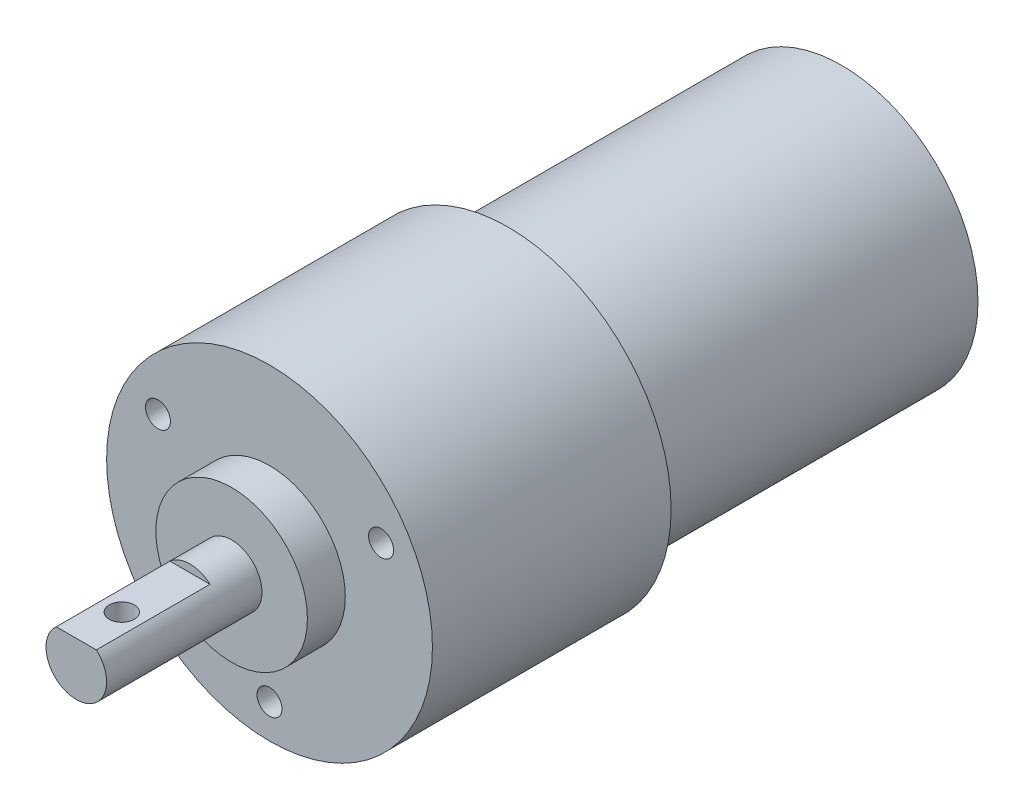
ISO-10303-21;
HEADER;
FILE_DESCRIPTION(('STEP AP214'),'2;1');
FILE_NAME('part.step','',(''),(''),'','','');
FILE_SCHEMA(('AUTOMOTIVE_DESIGN { 1 0 10303 214 1 1 1 1 }'));
ENDSEC;
DATA;
#1=APPLICATION_CONTEXT('core data for automotive mechanical design processes');
#2=APPLICATION_PROTOCOL_DEFINITION('international standard','automotive_design',2000,#1);
#3=PRODUCT_CONTEXT('',#1,'mechanical');
#4=PRODUCT('Part','Part','',(#3));
#5=PRODUCT_RELATED_PRODUCT_CATEGORY('part','',(#4));
#6=PRODUCT_DEFINITION_FORMATION('','',#4);
#7=PRODUCT_DEFINITION_CONTEXT('part definition',#1,'design');
#8=PRODUCT_DEFINITION('design','',#6,#7);
#9=PRODUCT_DEFINITION_SHAPE('','',#8);
#10=(LENGTH_UNIT() NAMED_UNIT(*) SI_UNIT(.MILLI.,.METRE.));
#11=(NAMED_UNIT(*) PLANE_ANGLE_UNIT() SI_UNIT($,.RADIAN.));
#12=(NAMED_UNIT(*) SI_UNIT($,.STERADIAN.) SOLID_ANGLE_UNIT());
#13=UNCERTAINTY_MEASURE_WITH_UNIT(LENGTH_MEASURE(1.E-05),#10,'distance_accuracy_value','');
#14=(GEOMETRIC_REPRESENTATION_CONTEXT(3) GLOBAL_UNCERTAINTY_ASSIGNED_CONTEXT((#13)) GLOBAL_UNIT_ASSIGNED_CONTEXT((#10,
#11,#12)) REPRESENTATION_CONTEXT('',''));
#15=CARTESIAN_POINT('',(0.,0.,0.));
#16=DIRECTION('',(0.,0.,1.));
#17=DIRECTION('',(1.,0.,0.));
#18=AXIS2_PLACEMENT_3D('',#15,#16,#17);
#19=CARTESIAN_POINT('',(0.,0.,57.));
#20=DIRECTION('',(0.,0.,-1.));
#21=DIRECTION('',(-1.,0.,0.));
#22=AXIS2_PLACEMENT_3D('',#19,#20,#21);
#23=CYLINDRICAL_SURFACE('',#22,4.);
#24=CARTESIAN_POINT('',(0.,-4.,52.65));
#25=CARTESIAN_POINT('',(0.0884596783632788,-3.99999309817074,52.6499907827934));
#26=CARTESIAN_POINT('',(0.177062252057582,-3.99703145792172,52.6428439856567));
#27=CARTESIAN_POINT('',(0.351759669836408,-3.9854711320255,52.6145088580631));
#28=CARTESIAN_POINT('',(0.437847271996959,-3.97685757767606,52.5932834889757));
#29=CARTESIAN_POINT('',(0.604702496902739,-3.95491965529936,52.5377051877981));
#30=CARTESIAN_POINT('',(0.685486934491194,-3.94161112398211,52.5033963566465));
#31=CARTESIAN_POINT('',(0.840076633223485,-3.91158286286531,52.4228052421506));
#32=CARTESIAN_POINT('',(0.913884076117563,-3.89486420463244,52.3765267188298));
#33=CARTESIAN_POINT('',(1.05618769598525,-3.85876900012149,52.2708932453559));
#34=CARTESIAN_POINT('',(1.12429373957476,-3.83930654387258,52.211042329751));
#35=CARTESIAN_POINT('',(1.24983574384757,-3.80029483347099,52.081011160341));
#36=CARTESIAN_POINT('',(1.30726618926956,-3.78074553976622,52.0108256007882));
#37=CARTESIAN_POINT('',(1.41254826809049,-3.74272551686067,51.8580317511283));
#38=CARTESIAN_POINT('',(1.45980781790561,-3.72435159658093,51.7749888846935));
#39=CARTESIAN_POINT('',(1.53951358199406,-3.69212136090386,51.6012636907098));
#40=CARTESIAN_POINT('',(1.5719672771279,-3.67826276509115,51.510585248637));
#41=CARTESIAN_POINT('',(1.61953738222491,-3.65756021871623,51.3286520029982));
#42=CARTESIAN_POINT('',(1.63540371417153,-3.65041449103237,51.2376289278569));
#43=CARTESIAN_POINT('',(1.65168918120802,-3.64307714795703,51.0539534926347));
#44=CARTESIAN_POINT('',(1.65211659474,-3.64288180572738,50.9613020323707));
#45=CARTESIAN_POINT('',(1.63807780779829,-3.64921138579605,50.7844011133813));
#46=CARTESIAN_POINT('',(1.62472398487458,-3.6552343974104,50.7000418412508));
#47=CARTESIAN_POINT('',(1.58536484231197,-3.67247532251837,50.5348897156188));
#48=CARTESIAN_POINT('',(1.55935715587184,-3.68369420783859,50.4540975323967));
#49=CARTESIAN_POINT('',(1.49492412942488,-3.71031458481431,50.2963548912414));
#50=CARTESIAN_POINT('',(1.45624866973016,-3.72579923184191,50.2195212621917));
#51=CARTESIAN_POINT('',(1.36775445443624,-3.75918616236907,50.07313976754));
#52=CARTESIAN_POINT('',(1.31793135478158,-3.77708938726885,50.0035947577509));
#53=CARTESIAN_POINT('',(1.20371911924868,-3.81509742396095,49.8677135922122));
#54=CARTESIAN_POINT('',(1.13846630094388,-3.8352618825369,49.8021180422967));
#55=CARTESIAN_POINT('',(0.99768255486621,-3.87426910607353,49.6825553255586));
#56=CARTESIAN_POINT('',(0.922149319847429,-3.8931115728953,49.6285907761392));
#57=CARTESIAN_POINT('',(0.76073636973732,-3.92787932271737,49.532765226415));
#58=CARTESIAN_POINT('',(0.674664094072232,-3.94373050716791,49.4911997168058));
#59=CARTESIAN_POINT('',(0.495928253552973,-3.97016319816605,49.4233969758911));
#60=CARTESIAN_POINT('',(0.403268287372381,-3.98074755693754,49.3971514467888));
#61=CARTESIAN_POINT('',(0.22018130431767,-3.99492450637935,49.3622704963218));
#62=CARTESIAN_POINT('',(0.129974172308219,-3.99891121146315,49.3526408220641));
#63=CARTESIAN_POINT('',(-0.0508474401522242,-4.00069746426785,49.3483079562367));
#64=CARTESIAN_POINT('',(-0.141461799500568,-3.99849874371343,49.3536005868918));
#65=CARTESIAN_POINT('',(-0.31590775548755,-3.98841747083847,49.378245268243));
#66=CARTESIAN_POINT('',(-0.399855317526687,-3.9808153168881,49.3969040733401));
#67=CARTESIAN_POINT('',(-0.563340473329576,-3.96098887803091,49.4467920963371));
#68=CARTESIAN_POINT('',(-0.642877505872146,-3.94876400644332,49.4780229098148));
#69=CARTESIAN_POINT('',(-0.798061975964474,-3.92039728883464,49.5531893799809));
#70=CARTESIAN_POINT('',(-0.873512656660505,-3.90414585630856,49.5974885617562));
#71=CARTESIAN_POINT('',(-1.01617847320907,-3.86946768187548,49.6971339342579));
#72=CARTESIAN_POINT('',(-1.0833901834211,-3.85104004134398,49.7524846950898));
#73=CARTESIAN_POINT('',(-1.21261994292741,-3.8124029584454,49.877204304812));
#74=CARTESIAN_POINT('',(-1.27394364561821,-3.79215916493832,49.9472838240393));
#75=CARTESIAN_POINT('',(-1.38414835482505,-3.75333928940831,50.0970712906085));
#76=CARTESIAN_POINT('',(-1.43302674162726,-3.73476355904109,50.1767812599426));
#77=CARTESIAN_POINT('',(-1.51742282291387,-3.70128700339843,50.3450953705333));
#78=CARTESIAN_POINT('',(-1.55275802936534,-3.68643724424496,50.4338019160081));
#79=CARTESIAN_POINT('',(-1.60769618165393,-3.66281640168181,50.6167091659782));
#80=CARTESIAN_POINT('',(-1.62731175174752,-3.65404044124936,50.7109053964182));
#81=CARTESIAN_POINT('',(-1.64901123940267,-3.64429559365239,50.8944302731581));
#82=CARTESIAN_POINT('',(-1.65231049364124,-3.64278573581524,50.9835872194579));
#83=CARTESIAN_POINT('',(-1.64451485356567,-3.64631178238904,51.1611284707592));
#84=CARTESIAN_POINT('',(-1.63342206561729,-3.65134672892697,51.2495128869194));
#85=CARTESIAN_POINT('',(-1.59817118006571,-3.666904904187,51.4189330712577));
#86=CARTESIAN_POINT('',(-1.57461958437453,-3.67717261200251,51.5001207114221));
#87=CARTESIAN_POINT('',(-1.51570599472927,-3.70184411206584,51.6574145224741));
#88=CARTESIAN_POINT('',(-1.48034069596892,-3.71624906152171,51.7335192642976));
#89=CARTESIAN_POINT('',(-1.3963806225379,-3.7486340889516,51.8834220382414));
#90=CARTESIAN_POINT('',(-1.34712443599271,-3.76677577854003,51.9568140710214));
#91=CARTESIAN_POINT('',(-1.23771718137822,-3.80412864636709,52.0946716872643));
#92=CARTESIAN_POINT('',(-1.17756245772962,-3.82334018195057,52.1591342627744));
#93=CARTESIAN_POINT('',(-1.04300738755743,-3.86230172013188,52.2819941387037));
#94=CARTESIAN_POINT('',(-0.967900110730172,-3.88199359359226,52.3396392236055));
#95=CARTESIAN_POINT('',(-0.808343463182029,-3.91832426905579,52.4415401595387));
#96=CARTESIAN_POINT('',(-0.723889843442846,-3.9349616732268,52.4857898863659));
#97=CARTESIAN_POINT('',(-0.549414760109623,-3.96305691394126,52.5586637398347));
#98=CARTESIAN_POINT('',(-0.459513381649419,-3.97459855421812,52.5875424253585));
#99=CARTESIAN_POINT('',(-0.275719229213235,-3.99154438775475,52.6295110847851));
#100=CARTESIAN_POINT('',(-0.181839966818024,-3.99696786149576,52.6426506662454));
#101=CARTESIAN_POINT('',(-0.0584442952271929,-3.99968194626838,52.64922677033));
#102=CARTESIAN_POINT('',(-0.0292299486703363,-4.00000228058838,52.6500030456642));
#103=CARTESIAN_POINT('',(0.,-4.,52.65));
#104=B_SPLINE_CURVE_WITH_KNOTS('',3,(#24,#25,#26,#27,#28,#29,#30,#31,#32,#33,#34,#35,#36,#37,
#38,#39,#40,#41,#42,#43,#44,#45,#46,#47,#48,#49,#50,#51,#52,#53,#54,#55,#56,#57,#58,#59,#60,#61,
#62,#63,#64,#65,#66,#67,#68,#69,#70,#71,#72,#73,#74,#75,#76,#77,#78,#79,#80,#81,#82,#83,#84,#85,
#86,#87,#88,#89,#90,#91,#92,#93,#94,#95,#96,#97,#98,#99,#100,#101,#102,#103),.UNSPECIFIED.,.T.,
.F.,(4,2,2,2,2,2,2,2,2,2,2,2,2,2,2,2,2,2,2,2,2,2,2,2,2,2,2,2,2,2,2,2,2,2,2,2,2,2,2,4),(0.,
0.26529709877062,0.531294937906658,0.79640398149888,1.06142984766523,1.33841878994456,
1.61555043582128,1.90598404924537,2.19627075414923,2.47277648539419,2.74913395037958,
3.00480633611682,3.2605265616686,3.5216353930134,3.78284615202013,4.06565185095454,
4.34852112528507,4.63767392136374,4.92666995726766,5.19768149557684,5.46861716672803,
5.72643264660552,5.98428085748382,6.25011488704504,6.5160590741843,6.800645802504,
7.08529238632155,7.37364985225778,7.66177550895673,7.92807823226719,8.19434198489782,
8.44869772098556,8.70312467109941,8.97267479984705,9.24231550885209,9.53104085816538,
9.81989801073175,10.1038095613048,10.3868238858898,10.4744866574817),.UNSPECIFIED.);
#105=CARTESIAN_POINT('',(0.,-4.,52.65));
#106=VERTEX_POINT('',#105);
#107=EDGE_CURVE('E42',#106,#106,#104,.T.);
#108=ORIENTED_EDGE('',*,*,#107,.T.);
#109=EDGE_LOOP('',(#108));
#110=FACE_BOUND('',#109,.T.);
#111=CARTESIAN_POINT('',(0.,0.,36.5));
#112=DIRECTION('',(0.,0.,1.));
#113=DIRECTION('',(1.,0.,0.));
#114=AXIS2_PLACEMENT_3D('',#111,#112,#113);
#115=CIRCLE('',#114,4.);
#116=CARTESIAN_POINT('',(4.,0.,36.5));
#117=VERTEX_POINT('',#116);
#118=EDGE_CURVE('E115',#117,#117,#115,.T.);
#119=ORIENTED_EDGE('',*,*,#118,.T.);
#120=EDGE_LOOP('',(#119));
#121=FACE_BOUND('',#120,.T.);
#122=DIRECTION('',(0.,0.,-1.));
#123=VECTOR('',#122,1.);
#124=CARTESIAN_POINT('',(2.64575131106459,3.,57.));
#125=LINE('',#124,#123);
#126=CARTESIAN_POINT('',(2.64575131106459,3.,57.));
#127=VERTEX_POINT('',#126);
#128=CARTESIAN_POINT('',(2.64575131106459,3.,42.));
#129=VERTEX_POINT('',#128);
#130=EDGE_CURVE('E110',#127,#129,#125,.T.);
#131=ORIENTED_EDGE('',*,*,#130,.F.);
#132=CARTESIAN_POINT('',(0.,0.,57.));
#133=DIRECTION('',(0.,0.,1.));
#134=DIRECTION('',(1.,0.,0.));
#135=AXIS2_PLACEMENT_3D('',#132,#133,#134);
#136=CIRCLE('',#135,4.);
#137=CARTESIAN_POINT('',(-2.64575131106459,3.,57.));
#138=VERTEX_POINT('',#137);
#139=EDGE_CURVE('E112',#138,#127,#136,.T.);
#140=ORIENTED_EDGE('',*,*,#139,.F.);
#141=DIRECTION('',(0.,0.,-1.));
#142=VECTOR('',#141,1.);
#143=CARTESIAN_POINT('',(-2.64575131106459,3.,57.));
#144=LINE('',#143,#142);
#145=CARTESIAN_POINT('',(-2.64575131106459,3.,42.));
#146=VERTEX_POINT('',#145);
#147=EDGE_CURVE('E59',#146,#138,#144,.F.);
#148=ORIENTED_EDGE('',*,*,#147,.F.);
#149=CARTESIAN_POINT('',(0.,0.,42.));
#150=DIRECTION('',(0.,0.,1.));
#151=DIRECTION('',(1.,0.,0.));
#152=AXIS2_PLACEMENT_3D('',#149,#150,#151);
#153=CIRCLE('',#152,4.);
#154=EDGE_CURVE('E11',#129,#146,#153,.T.);
#155=ORIENTED_EDGE('',*,*,#154,.F.);
#156=EDGE_LOOP('',(#131,#140,#148,#155));
#157=FACE_BOUND('',#156,.T.);
#158=ADVANCED_FACE('F38',(#110,#121,#157),#23,.T.);
#159=CARTESIAN_POINT('',(0.,0.,57.));
#160=DIRECTION('',(0.,0.,1.));
#161=DIRECTION('',(1.,0.,0.));
#162=AXIS2_PLACEMENT_3D('',#159,#160,#161);
#163=PLANE('',#162);
#164=ORIENTED_EDGE('',*,*,#139,.T.);
#165=DIRECTION('',(-1.,0.,0.));
#166=VECTOR('',#165,1.);
#167=CARTESIAN_POINT('',(0.,3.,57.));
#168=LINE('',#167,#166);
#169=EDGE_CURVE('E52',#127,#138,#168,.T.);
#170=ORIENTED_EDGE('',*,*,#169,.T.);
#171=EDGE_LOOP('',(#164,#170));
#172=FACE_BOUND('',#171,.T.);
#173=ADVANCED_FACE('F138',(#172),#163,.T.);
#174=CARTESIAN_POINT('',(0.,0.,31.5));
#175=DIRECTION('',(0.,0.,-1.));
#176=DIRECTION('',(-1.,0.,0.));
#177=AXIS2_PLACEMENT_3D('',#174,#175,#176);
#178=CYLINDRICAL_SURFACE('',#177,21.5);
#179=CARTESIAN_POINT('',(0.,0.,31.5));
#180=DIRECTION('',(0.,0.,1.));
#181=DIRECTION('',(1.,0.,0.));
#182=AXIS2_PLACEMENT_3D('',#179,#180,#181);
#183=CIRCLE('',#182,21.5);
#184=CARTESIAN_POINT('',(21.5,0.,31.5));
#185=VERTEX_POINT('',#184);
#186=EDGE_CURVE('E131',#185,#185,#183,.T.);
#187=ORIENTED_EDGE('',*,*,#186,.F.);
#188=EDGE_LOOP('',(#187));
#189=FACE_BOUND('',#188,.T.);
#190=CARTESIAN_POINT('',(0.,0.,0.));
#191=DIRECTION('',(0.,0.,1.));
#192=DIRECTION('',(1.,0.,0.));
#193=AXIS2_PLACEMENT_3D('',#190,#191,#192);
#194=CIRCLE('',#193,21.5);
#195=CARTESIAN_POINT('',(21.5,0.,0.));
#196=VERTEX_POINT('',#195);
#197=EDGE_CURVE('E128',#196,#196,#194,.T.);
#198=ORIENTED_EDGE('',*,*,#197,.T.);
#199=EDGE_LOOP('',(#198));
#200=FACE_BOUND('',#199,.T.);
#201=ADVANCED_FACE('F40',(#189,#200),#178,.T.);
#202=CARTESIAN_POINT('',(0.,0.,31.5));
#203=DIRECTION('',(0.,0.,1.));
#204=DIRECTION('',(1.,0.,0.));
#205=AXIS2_PLACEMENT_3D('',#202,#203,#204);
#206=PLANE('',#205);
#207=CARTESIAN_POINT('',(0.,-17.,31.5));
#208=DIRECTION('',(0.,0.,1.));
#209=DIRECTION('',(1.,0.,0.));
#210=AXIS2_PLACEMENT_3D('',#207,#208,#209);
#211=CIRCLE('',#210,1.65);
#212=CARTESIAN_POINT('',(1.65,-17.,31.5));
#213=VERTEX_POINT('',#212);
#214=EDGE_CURVE('E90',#213,#213,#211,.T.);
#215=ORIENTED_EDGE('',*,*,#214,.F.);
#216=EDGE_LOOP('',(#215));
#217=FACE_BOUND('',#216,.T.);
#218=CARTESIAN_POINT('',(-14.7224318643348,8.49999999999998,31.5));
#219=DIRECTION('',(0.,0.,1.));
#220=DIRECTION('',(1.,0.,0.));
#221=AXIS2_PLACEMENT_3D('',#218,#219,#220);
#222=CIRCLE('',#221,1.65);
#223=CARTESIAN_POINT('',(-13.0724318643348,8.49999999999998,31.5));
#224=VERTEX_POINT('',#223);
#225=EDGE_CURVE('E89',#224,#224,#222,.T.);
#226=ORIENTED_EDGE('',*,*,#225,.F.);
#227=EDGE_LOOP('',(#226));
#228=FACE_BOUND('',#227,.T.);
#229=CARTESIAN_POINT('',(14.7224318643356,8.4999999999993,31.5));
#230=DIRECTION('',(0.,0.,1.));
#231=DIRECTION('',(1.,0.,0.));
#232=AXIS2_PLACEMENT_3D('',#229,#230,#231);
#233=CIRCLE('',#232,1.65);
#234=CARTESIAN_POINT('',(16.3724318643356,8.4999999999993,31.5));
#235=VERTEX_POINT('',#234);
#236=EDGE_CURVE('E101',#235,#235,#233,.T.);
#237=ORIENTED_EDGE('',*,*,#236,.F.);
#238=EDGE_LOOP('',(#237));
#239=FACE_BOUND('',#238,.T.);
#240=CARTESIAN_POINT('',(0.,0.,31.5));
#241=DIRECTION('',(0.,0.,1.));
#242=DIRECTION('',(1.,0.,0.));
#243=AXIS2_PLACEMENT_3D('',#240,#241,#242);
#244=CIRCLE('',#243,10.);
#245=CARTESIAN_POINT('',(10.,0.,31.5));
#246=VERTEX_POINT('',#245);
#247=EDGE_CURVE('E118',#246,#246,#244,.T.);
#248=ORIENTED_EDGE('',*,*,#247,.F.);
#249=EDGE_LOOP('',(#248));
#250=FACE_BOUND('',#249,.T.);
#251=ORIENTED_EDGE('',*,*,#186,.T.);
#252=EDGE_LOOP('',(#251));
#253=FACE_BOUND('',#252,.T.);
#254=ADVANCED_FACE('F178',(#217,#228,#239,#250,#253),#206,.T.);
#255=CARTESIAN_POINT('',(0.,0.,0.));
#256=DIRECTION('',(0.,0.,1.));
#257=DIRECTION('',(1.,0.,0.));
#258=AXIS2_PLACEMENT_3D('',#255,#256,#257);
#259=PLANE('',#258);
#260=CARTESIAN_POINT('',(0.,0.,0.));
#261=DIRECTION('',(0.,0.,1.));
#262=DIRECTION('',(1.,0.,0.));
#263=AXIS2_PLACEMENT_3D('',#260,#261,#262);
#264=CIRCLE('',#263,18.);
#265=CARTESIAN_POINT('',(18.,0.,0.));
#266=VERTEX_POINT('',#265);
#267=EDGE_CURVE('E122',#266,#266,#264,.T.);
#268=ORIENTED_EDGE('',*,*,#267,.T.);
#269=EDGE_LOOP('',(#268));
#270=FACE_BOUND('',#269,.T.);
#271=ORIENTED_EDGE('',*,*,#197,.F.);
#272=EDGE_LOOP('',(#271));
#273=FACE_BOUND('',#272,.T.);
#274=ADVANCED_FACE('F176',(#270,#273),#259,.F.);
#275=CARTESIAN_POINT('',(0.,0.,-44.));
#276=DIRECTION('',(0.,0.,1.));
#277=DIRECTION('',(1.,0.,0.));
#278=AXIS2_PLACEMENT_3D('',#275,#276,#277);
#279=CYLINDRICAL_SURFACE('',#278,18.);
#280=CARTESIAN_POINT('',(0.,0.,-44.));
#281=DIRECTION('',(0.,0.,1.));
#282=DIRECTION('',(1.,0.,0.));
#283=AXIS2_PLACEMENT_3D('',#280,#281,#282);
#284=CIRCLE('',#283,18.);
#285=CARTESIAN_POINT('',(18.,0.,-44.));
#286=VERTEX_POINT('',#285);
#287=EDGE_CURVE('E125',#286,#286,#284,.T.);
#288=ORIENTED_EDGE('',*,*,#287,.T.);
#289=EDGE_LOOP('',(#288));
#290=FACE_BOUND('',#289,.T.);
#291=ORIENTED_EDGE('',*,*,#267,.F.);
#292=EDGE_LOOP('',(#291));
#293=FACE_BOUND('',#292,.T.);
#294=ADVANCED_FACE('F172',(#290,#293),#279,.T.);
#295=CARTESIAN_POINT('',(0.,0.,-44.));
#296=DIRECTION('',(0.,0.,1.));
#297=DIRECTION('',(1.,0.,0.));
#298=AXIS2_PLACEMENT_3D('',#295,#296,#297);
#299=PLANE('',#298);
#300=ORIENTED_EDGE('',*,*,#287,.F.);
#301=EDGE_LOOP('',(#300));
#302=FACE_BOUND('',#301,.T.);
#303=ADVANCED_FACE('F167',(#302),#299,.F.);
#304=CARTESIAN_POINT('',(0.,0.,36.5));
#305=DIRECTION('',(0.,0.,1.));
#306=DIRECTION('',(1.,0.,0.));
#307=AXIS2_PLACEMENT_3D('',#304,#305,#306);
#308=PLANE('',#307);
#309=CARTESIAN_POINT('',(0.,0.,36.5));
#310=DIRECTION('',(0.,0.,1.));
#311=DIRECTION('',(1.,0.,0.));
#312=AXIS2_PLACEMENT_3D('',#309,#310,#311);
#313=CIRCLE('',#312,10.);
#314=CARTESIAN_POINT('',(10.,0.,36.5));
#315=VERTEX_POINT('',#314);
#316=EDGE_CURVE('E119',#315,#315,#313,.T.);
#317=ORIENTED_EDGE('',*,*,#316,.T.);
#318=EDGE_LOOP('',(#317));
#319=FACE_BOUND('',#318,.T.);
#320=ORIENTED_EDGE('',*,*,#118,.F.);
#321=EDGE_LOOP('',(#320));
#322=FACE_BOUND('',#321,.T.);
#323=ADVANCED_FACE('F153',(#319,#322),#308,.T.);
#324=CARTESIAN_POINT('',(0.,0.,36.5));
#325=DIRECTION('',(0.,0.,-1.));
#326=DIRECTION('',(-1.,0.,0.));
#327=AXIS2_PLACEMENT_3D('',#324,#325,#326);
#328=CYLINDRICAL_SURFACE('',#327,10.);
#329=ORIENTED_EDGE('',*,*,#316,.F.);
#330=EDGE_LOOP('',(#329));
#331=FACE_BOUND('',#330,.T.);
#332=ORIENTED_EDGE('',*,*,#247,.T.);
#333=EDGE_LOOP('',(#332));
#334=FACE_BOUND('',#333,.T.);
#335=ADVANCED_FACE('F144',(#331,#334),#328,.T.);
#336=CARTESIAN_POINT('',(-7.9530852202903,21.5,42.));
#337=DIRECTION('',(0.,0.,1.));
#338=DIRECTION('',(1.,0.,0.));
#339=AXIS2_PLACEMENT_3D('',#336,#337,#338);
#340=PLANE('',#339);
#341=ORIENTED_EDGE('',*,*,#154,.T.);
#342=DIRECTION('',(-1.,0.,0.));
#343=VECTOR('',#342,1.);
#344=CARTESIAN_POINT('',(-7.9530852202903,3.,42.));
#345=LINE('',#344,#343);
#346=EDGE_CURVE('E107',#129,#146,#345,.T.);
#347=ORIENTED_EDGE('',*,*,#346,.F.);
#348=EDGE_LOOP('',(#341,#347));
#349=FACE_BOUND('',#348,.T.);
#350=ADVANCED_FACE('F142',(#349),#340,.T.);
#351=CARTESIAN_POINT('',(0.,3.,0.));
#352=DIRECTION('',(0.,1.,0.));
#353=DIRECTION('',(0.,0.,1.));
#354=AXIS2_PLACEMENT_3D('',#351,#352,#353);
#355=PLANE('',#354);
#356=CARTESIAN_POINT('',(0.,3.,51.));
#357=DIRECTION('',(0.,1.,0.));
#358=DIRECTION('',(0.,0.,1.));
#359=AXIS2_PLACEMENT_3D('',#356,#357,#358);
#360=CIRCLE('',#359,1.64999999999999);
#361=CARTESIAN_POINT('',(0.,3.,52.65));
#362=VERTEX_POINT('',#361);
#363=EDGE_CURVE('E298',#362,#362,#360,.T.);
#364=ORIENTED_EDGE('',*,*,#363,.F.);
#365=EDGE_LOOP('',(#364));
#366=FACE_BOUND('',#365,.T.);
#367=ORIENTED_EDGE('',*,*,#130,.T.);
#368=ORIENTED_EDGE('',*,*,#346,.T.);
#369=ORIENTED_EDGE('',*,*,#147,.T.);
#370=ORIENTED_EDGE('',*,*,#169,.F.);
#371=EDGE_LOOP('',(#367,#368,#369,#370));
#372=FACE_BOUND('',#371,.T.);
#373=ADVANCED_FACE('F141',(#366,#372),#355,.T.);
#374=CARTESIAN_POINT('',(14.7224318643356,8.4999999999993,20.));
#375=DIRECTION('',(0.,0.,1.));
#376=DIRECTION('',(1.,0.,0.));
#377=AXIS2_PLACEMENT_3D('',#374,#375,#376);
#378=CONICAL_SURFACE('',#377,1.65,1.02974425867665);
#379=CARTESIAN_POINT('',(14.7224318643356,8.4999999999993,19.0085799786045));
#380=VERTEX_POINT('',#379);
#381=VERTEX_LOOP('',#380);
#382=FACE_BOUND('',#381,.T.);
#383=CARTESIAN_POINT('',(14.7224318643356,8.4999999999993,20.));
#384=DIRECTION('',(0.,0.,1.));
#385=DIRECTION('',(1.,0.,0.));
#386=AXIS2_PLACEMENT_3D('',#383,#384,#385);
#387=CIRCLE('',#386,1.65);
#388=CARTESIAN_POINT('',(16.3724318643356,8.4999999999993,20.));
#389=VERTEX_POINT('',#388);
#390=EDGE_CURVE('E104',#389,#389,#387,.T.);
#391=ORIENTED_EDGE('',*,*,#390,.T.);
#392=EDGE_LOOP('',(#391));
#393=FACE_BOUND('',#392,.T.);
#394=ADVANCED_FACE('F150',(#382,#393),#378,.F.);
#395=CARTESIAN_POINT('',(14.7224318643356,8.4999999999993,31.5));
#396=DIRECTION('',(0.,0.,1.));
#397=DIRECTION('',(1.,0.,0.));
#398=AXIS2_PLACEMENT_3D('',#395,#396,#397);
#399=CYLINDRICAL_SURFACE('',#398,1.65);
#400=ORIENTED_EDGE('',*,*,#390,.F.);
#401=EDGE_LOOP('',(#400));
#402=FACE_BOUND('',#401,.T.);
#403=ORIENTED_EDGE('',*,*,#236,.T.);
#404=EDGE_LOOP('',(#403));
#405=FACE_BOUND('',#404,.T.);
#406=ADVANCED_FACE('F213',(#402,#405),#399,.F.);
#407=CARTESIAN_POINT('',(-14.7224318643348,8.49999999999998,20.));
#408=DIRECTION('',(0.,0.,1.));
#409=DIRECTION('',(1.,0.,0.));
#410=AXIS2_PLACEMENT_3D('',#407,#408,#409);
#411=CONICAL_SURFACE('',#410,1.65,1.02974425867665);
#412=CARTESIAN_POINT('',(-14.7224318643348,8.49999999999998,19.0085799786045));
#413=VERTEX_POINT('',#412);
#414=VERTEX_LOOP('',#413);
#415=FACE_BOUND('',#414,.T.);
#416=CARTESIAN_POINT('',(-14.7224318643348,8.49999999999998,20.));
#417=DIRECTION('',(0.,0.,1.));
#418=DIRECTION('',(1.,0.,0.));
#419=AXIS2_PLACEMENT_3D('',#416,#417,#418);
#420=CIRCLE('',#419,1.65);
#421=CARTESIAN_POINT('',(-13.0724318643348,8.49999999999998,20.));
#422=VERTEX_POINT('',#421);
#423=EDGE_CURVE('E93',#422,#422,#420,.T.);
#424=ORIENTED_EDGE('',*,*,#423,.T.);
#425=EDGE_LOOP('',(#424));
#426=FACE_BOUND('',#425,.T.);
#427=ADVANCED_FACE('F225',(#415,#426),#411,.F.);
#428=CARTESIAN_POINT('',(-14.7224318643348,8.49999999999998,31.5));
#429=DIRECTION('',(0.,0.,1.));
#430=DIRECTION('',(1.,0.,0.));
#431=AXIS2_PLACEMENT_3D('',#428,#429,#430);
#432=CYLINDRICAL_SURFACE('',#431,1.65);
#433=ORIENTED_EDGE('',*,*,#423,.F.);
#434=EDGE_LOOP('',(#433));
#435=FACE_BOUND('',#434,.T.);
#436=ORIENTED_EDGE('',*,*,#225,.T.);
#437=EDGE_LOOP('',(#436));
#438=FACE_BOUND('',#437,.T.);
#439=ADVANCED_FACE('F83',(#435,#438),#432,.F.);
#440=CARTESIAN_POINT('',(0.,-17.,20.));
#441=DIRECTION('',(0.,0.,1.));
#442=DIRECTION('',(1.,0.,0.));
#443=AXIS2_PLACEMENT_3D('',#440,#441,#442);
#444=CONICAL_SURFACE('',#443,1.65,1.02974425867665);
#445=CARTESIAN_POINT('',(0.,-17.,19.0085799786045));
#446=VERTEX_POINT('',#445);
#447=VERTEX_LOOP('',#446);
#448=FACE_BOUND('',#447,.T.);
#449=CARTESIAN_POINT('',(0.,-17.,20.));
#450=DIRECTION('',(0.,0.,1.));
#451=DIRECTION('',(1.,0.,0.));
#452=AXIS2_PLACEMENT_3D('',#449,#450,#451);
#453=CIRCLE('',#452,1.65);
#454=CARTESIAN_POINT('',(1.65,-17.,20.));
#455=VERTEX_POINT('',#454);
#456=EDGE_CURVE('E87',#455,#455,#453,.T.);
#457=ORIENTED_EDGE('',*,*,#456,.T.);
#458=EDGE_LOOP('',(#457));
#459=FACE_BOUND('',#458,.T.);
#460=ADVANCED_FACE('F79',(#448,#459),#444,.F.);
#461=CARTESIAN_POINT('',(0.,-17.,31.5));
#462=DIRECTION('',(0.,0.,1.));
#463=DIRECTION('',(1.,0.,0.));
#464=AXIS2_PLACEMENT_3D('',#461,#462,#463);
#465=CYLINDRICAL_SURFACE('',#464,1.65);
#466=ORIENTED_EDGE('',*,*,#456,.F.);
#467=EDGE_LOOP('',(#466));
#468=FACE_BOUND('',#467,.T.);
#469=ORIENTED_EDGE('',*,*,#214,.T.);
#470=EDGE_LOOP('',(#469));
#471=FACE_BOUND('',#470,.T.);
#472=ADVANCED_FACE('F82',(#468,#471),#465,.F.);
#473=CARTESIAN_POINT('',(0.,3.,51.));
#474=DIRECTION('',(0.,1.,0.));
#475=DIRECTION('',(0.,0.,1.));
#476=AXIS2_PLACEMENT_3D('',#473,#474,#475);
#477=CYLINDRICAL_SURFACE('',#476,1.64999999999999);
#478=ORIENTED_EDGE('',*,*,#363,.T.);
#479=EDGE_LOOP('',(#478));
#480=FACE_BOUND('',#479,.T.);
#481=ORIENTED_EDGE('',*,*,#107,.F.);
#482=EDGE_LOOP('',(#481));
#483=FACE_BOUND('',#482,.T.);
#484=ADVANCED_FACE('F263',(#480,#483),#477,.F.);
#485=CLOSED_SHELL('',(#158,#173,#201,#254,#274,#294,#303,#323,#335,#350,#373,#394,#406,#427,
#439,#460,#472,#484));
#486=MANIFOLD_SOLID_BREP('B2',#485);
#487=ADVANCED_BREP_SHAPE_REPRESENTATION('',(#18,#486),#14);
#488=SHAPE_DEFINITION_REPRESENTATION(#9,#487);
ENDSEC;
END-ISO-10303-21;
